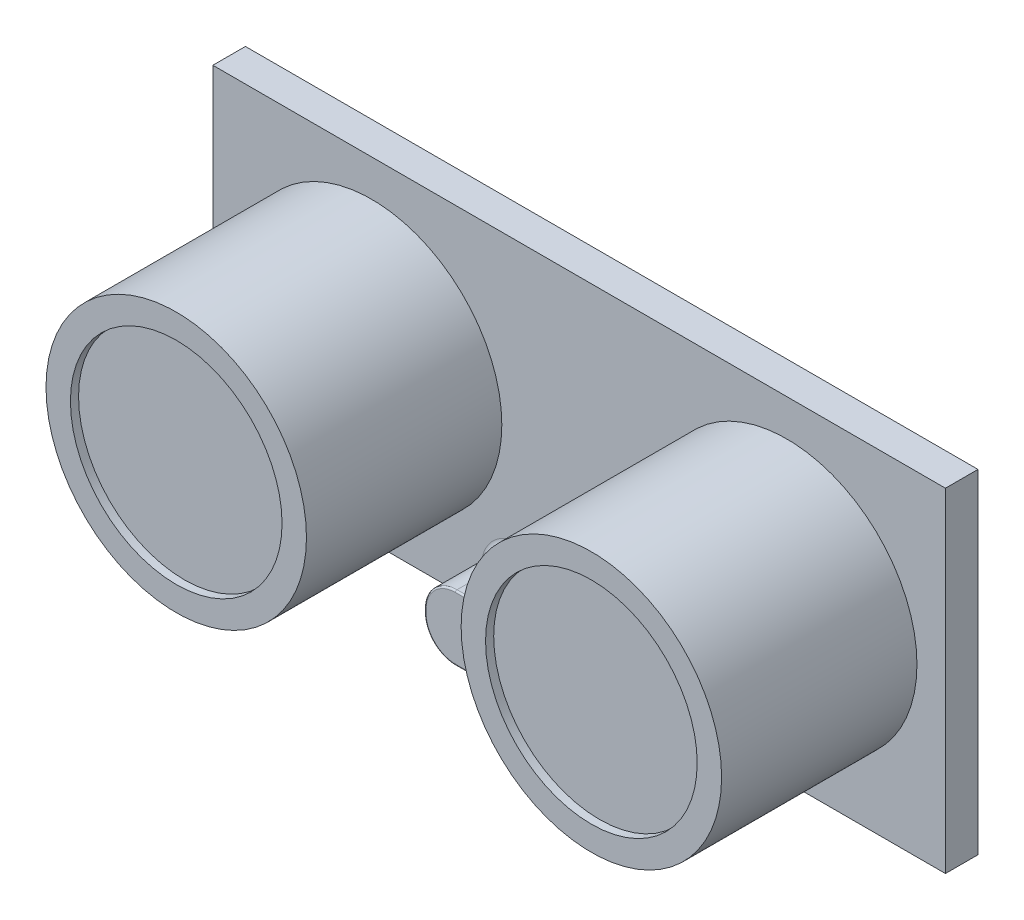
ISO-10303-21;
HEADER;
FILE_DESCRIPTION(('STEP AP214'),'2;1');
FILE_NAME('part.step','',(''),(''),'','','');
FILE_SCHEMA(('AUTOMOTIVE_DESIGN { 1 0 10303 214 1 1 1 1 }'));
ENDSEC;
DATA;
#1=APPLICATION_CONTEXT('core data for automotive mechanical design processes');
#2=APPLICATION_PROTOCOL_DEFINITION('international standard','automotive_design',2000,#1);
#3=PRODUCT_CONTEXT('',#1,'mechanical');
#4=PRODUCT('Part','Part','',(#3));
#5=PRODUCT_RELATED_PRODUCT_CATEGORY('part','',(#4));
#6=PRODUCT_DEFINITION_FORMATION('','',#4);
#7=PRODUCT_DEFINITION_CONTEXT('part definition',#1,'design');
#8=PRODUCT_DEFINITION('design','',#6,#7);
#9=PRODUCT_DEFINITION_SHAPE('','',#8);
#10=(LENGTH_UNIT() NAMED_UNIT(*) SI_UNIT(.MILLI.,.METRE.));
#11=(NAMED_UNIT(*) PLANE_ANGLE_UNIT() SI_UNIT($,.RADIAN.));
#12=(NAMED_UNIT(*) SI_UNIT($,.STERADIAN.) SOLID_ANGLE_UNIT());
#13=UNCERTAINTY_MEASURE_WITH_UNIT(LENGTH_MEASURE(1.E-05),#10,'distance_accuracy_value','');
#14=(GEOMETRIC_REPRESENTATION_CONTEXT(3) GLOBAL_UNCERTAINTY_ASSIGNED_CONTEXT((#13)) GLOBAL_UNIT_ASSIGNED_CONTEXT((#10,
#11,#12)) REPRESENTATION_CONTEXT('',''));
#15=CARTESIAN_POINT('',(0.,0.,0.));
#16=DIRECTION('',(0.,0.,1.));
#17=DIRECTION('',(1.,0.,0.));
#18=AXIS2_PLACEMENT_3D('',#15,#16,#17);
#19=CARTESIAN_POINT('',(0.,0.,2.));
#20=DIRECTION('',(0.,0.,1.));
#21=DIRECTION('',(1.,0.,0.));
#22=AXIS2_PLACEMENT_3D('',#19,#20,#21);
#23=PLANE('',#22);
#24=CARTESIAN_POINT('',(12.75,0.,2.));
#25=DIRECTION('',(0.,0.,1.));
#26=DIRECTION('',(1.,0.,0.));
#27=AXIS2_PLACEMENT_3D('',#24,#25,#26);
#28=CIRCLE('',#27,8.);
#29=CARTESIAN_POINT('',(20.75,0.,2.));
#30=VERTEX_POINT('',#29);
#31=EDGE_CURVE('E199',#30,#30,#28,.T.);
#32=ORIENTED_EDGE('',*,*,#31,.F.);
#33=EDGE_LOOP('',(#32));
#34=FACE_BOUND('',#33,.T.);
#35=CARTESIAN_POINT('',(-12.75,0.,2.));
#36=DIRECTION('',(0.,0.,1.));
#37=DIRECTION('',(1.,0.,0.));
#38=AXIS2_PLACEMENT_3D('',#35,#36,#37);
#39=CIRCLE('',#38,8.);
#40=CARTESIAN_POINT('',(-4.75000000000001,0.,2.));
#41=VERTEX_POINT('',#40);
#42=EDGE_CURVE('E376',#41,#41,#39,.T.);
#43=ORIENTED_EDGE('',*,*,#42,.F.);
#44=EDGE_LOOP('',(#43));
#45=FACE_BOUND('',#44,.T.);
#46=DIRECTION('',(0.,1.,0.));
#47=VECTOR('',#46,1.);
#48=CARTESIAN_POINT('',(5.99999999999999,0.,2.));
#49=LINE('',#48,#47);
#50=CARTESIAN_POINT('',(5.99999999999999,-8.15000000000001,2.));
#51=VERTEX_POINT('',#50);
#52=CARTESIAN_POINT('',(5.99999999999999,-8.34999999999998,2.));
#53=VERTEX_POINT('',#52);
#54=EDGE_CURVE('E279',#51,#53,#49,.F.);
#55=ORIENTED_EDGE('',*,*,#54,.T.);
#56=CARTESIAN_POINT('',(3.59999999999999,-8.34999999999999,2.));
#57=DIRECTION('',(0.,0.,1.));
#58=DIRECTION('',(1.,0.,0.));
#59=AXIS2_PLACEMENT_3D('',#56,#57,#58);
#60=CIRCLE('',#59,2.4);
#61=CARTESIAN_POINT('',(5.06628782986151,-10.25,2.));
#62=VERTEX_POINT('',#61);
#63=EDGE_CURVE('E281',#53,#62,#60,.F.);
#64=ORIENTED_EDGE('',*,*,#63,.T.);
#65=DIRECTION('',(1.,0.,0.));
#66=VECTOR('',#65,1.);
#67=CARTESIAN_POINT('',(22.5,-10.25,2.));
#68=LINE('',#67,#66);
#69=CARTESIAN_POINT('',(22.5,-10.25,2.));
#70=VERTEX_POINT('',#69);
#71=EDGE_CURVE('E185',#62,#70,#68,.T.);
#72=ORIENTED_EDGE('',*,*,#71,.T.);
#73=DIRECTION('',(0.,1.,0.));
#74=VECTOR('',#73,1.);
#75=CARTESIAN_POINT('',(22.5,-10.25,2.));
#76=LINE('',#75,#74);
#77=CARTESIAN_POINT('',(22.5,10.25,2.));
#78=VERTEX_POINT('',#77);
#79=EDGE_CURVE('E184',#70,#78,#76,.T.);
#80=ORIENTED_EDGE('',*,*,#79,.T.);
#81=DIRECTION('',(-1.,0.,0.));
#82=VECTOR('',#81,1.);
#83=CARTESIAN_POINT('',(22.5,10.25,2.));
#84=LINE('',#83,#82);
#85=CARTESIAN_POINT('',(-22.5,10.25,2.));
#86=VERTEX_POINT('',#85);
#87=EDGE_CURVE('E190',#78,#86,#84,.T.);
#88=ORIENTED_EDGE('',*,*,#87,.T.);
#89=DIRECTION('',(0.,-1.,0.));
#90=VECTOR('',#89,1.);
#91=CARTESIAN_POINT('',(-22.5,-10.25,2.));
#92=LINE('',#91,#90);
#93=CARTESIAN_POINT('',(-22.5,-10.25,2.));
#94=VERTEX_POINT('',#93);
#95=EDGE_CURVE('E188',#86,#94,#92,.T.);
#96=ORIENTED_EDGE('',*,*,#95,.T.);
#97=CARTESIAN_POINT('',(-5.06628782986152,-10.25,2.));
#98=VERTEX_POINT('',#97);
#99=EDGE_CURVE('E175',#94,#98,#68,.T.);
#100=ORIENTED_EDGE('',*,*,#99,.T.);
#101=CARTESIAN_POINT('',(-3.60000000000001,-8.35,2.));
#102=DIRECTION('',(0.,0.,1.));
#103=DIRECTION('',(1.,0.,0.));
#104=AXIS2_PLACEMENT_3D('',#101,#102,#103);
#105=CIRCLE('',#104,2.4);
#106=CARTESIAN_POINT('',(-6.00000000000001,-8.35,2.));
#107=VERTEX_POINT('',#106);
#108=EDGE_CURVE('E269',#98,#107,#105,.F.);
#109=ORIENTED_EDGE('',*,*,#108,.T.);
#110=DIRECTION('',(0.,-1.,0.));
#111=VECTOR('',#110,1.);
#112=CARTESIAN_POINT('',(-6.00000000000001,0.,2.));
#113=LINE('',#112,#111);
#114=CARTESIAN_POINT('',(-6.00000000000001,-8.15000000000001,2.));
#115=VERTEX_POINT('',#114);
#116=EDGE_CURVE('E271',#107,#115,#113,.F.);
#117=ORIENTED_EDGE('',*,*,#116,.T.);
#118=CARTESIAN_POINT('',(-3.60000000000001,-8.15,2.));
#119=DIRECTION('',(0.,0.,1.));
#120=DIRECTION('',(1.,0.,0.));
#121=AXIS2_PLACEMENT_3D('',#118,#119,#120);
#122=CIRCLE('',#121,2.4);
#123=CARTESIAN_POINT('',(-3.6,-5.75,2.));
#124=VERTEX_POINT('',#123);
#125=EDGE_CURVE('E273',#115,#124,#122,.F.);
#126=ORIENTED_EDGE('',*,*,#125,.T.);
#127=DIRECTION('',(-1.,0.,0.));
#128=VECTOR('',#127,1.);
#129=CARTESIAN_POINT('',(0.,-5.75,2.));
#130=LINE('',#129,#128);
#131=CARTESIAN_POINT('',(3.59999999999997,-5.74999999999999,2.));
#132=VERTEX_POINT('',#131);
#133=EDGE_CURVE('E275',#124,#132,#130,.F.);
#134=ORIENTED_EDGE('',*,*,#133,.T.);
#135=CARTESIAN_POINT('',(3.59999999999999,-8.15,2.));
#136=DIRECTION('',(0.,0.,1.));
#137=DIRECTION('',(1.,0.,0.));
#138=AXIS2_PLACEMENT_3D('',#135,#136,#137);
#139=CIRCLE('',#138,2.4);
#140=EDGE_CURVE('E277',#132,#51,#139,.F.);
#141=ORIENTED_EDGE('',*,*,#140,.T.);
#142=EDGE_LOOP('',(#55,#64,#72,#80,#88,#96,#100,#109,#117,#126,#134,#141));
#143=FACE_BOUND('',#142,.T.);
#144=ADVANCED_FACE('F34',(#34,#45,#143),#23,.T.);
#145=CARTESIAN_POINT('',(-22.5,-10.25,2.));
#146=DIRECTION('',(1.,0.,0.));
#147=DIRECTION('',(0.,0.,-1.));
#148=AXIS2_PLACEMENT_3D('',#145,#146,#147);
#149=PLANE('',#148);
#150=DIRECTION('',(0.,-1.,0.));
#151=VECTOR('',#150,1.);
#152=CARTESIAN_POINT('',(-22.5,-10.25,0.));
#153=LINE('',#152,#151);
#154=CARTESIAN_POINT('',(-22.5,10.25,0.));
#155=VERTEX_POINT('',#154);
#156=CARTESIAN_POINT('',(-22.5,-10.25,0.));
#157=VERTEX_POINT('',#156);
#158=EDGE_CURVE('E198',#155,#157,#153,.T.);
#159=ORIENTED_EDGE('',*,*,#158,.T.);
#160=DIRECTION('',(0.,0.,-1.));
#161=VECTOR('',#160,1.);
#162=CARTESIAN_POINT('',(-22.5,-10.25,2.));
#163=LINE('',#162,#161);
#164=EDGE_CURVE('E179',#94,#157,#163,.T.);
#165=ORIENTED_EDGE('',*,*,#164,.F.);
#166=ORIENTED_EDGE('',*,*,#95,.F.);
#167=DIRECTION('',(0.,0.,-1.));
#168=VECTOR('',#167,1.);
#169=CARTESIAN_POINT('',(-22.5,10.25,2.));
#170=LINE('',#169,#168);
#171=EDGE_CURVE('E366',#86,#155,#170,.T.);
#172=ORIENTED_EDGE('',*,*,#171,.T.);
#173=EDGE_LOOP('',(#159,#165,#166,#172));
#174=FACE_BOUND('',#173,.T.);
#175=ADVANCED_FACE('F196',(#174),#149,.F.);
#176=CARTESIAN_POINT('',(22.5,-10.25,2.));
#177=DIRECTION('',(0.,1.,0.));
#178=DIRECTION('',(-1.,0.,0.));
#179=AXIS2_PLACEMENT_3D('',#176,#177,#178);
#180=PLANE('',#179);
#181=DIRECTION('',(0.,0.,-1.));
#182=VECTOR('',#181,1.);
#183=CARTESIAN_POINT('',(3.59999999999998,-10.25,6.));
#184=LINE('',#183,#182);
#185=CARTESIAN_POINT('',(3.59999999999998,-10.25,5.9));
#186=VERTEX_POINT('',#185);
#187=CARTESIAN_POINT('',(3.59999999999998,-10.25,2.5));
#188=VERTEX_POINT('',#187);
#189=EDGE_CURVE('E266',#186,#188,#184,.T.);
#190=ORIENTED_EDGE('',*,*,#189,.F.);
#191=DIRECTION('',(1.,0.,0.));
#192=VECTOR('',#191,1.);
#193=CARTESIAN_POINT('',(-3.6,-10.25,5.9));
#194=LINE('',#193,#192);
#195=CARTESIAN_POINT('',(-3.6,-10.25,5.9));
#196=VERTEX_POINT('',#195);
#197=EDGE_CURVE('E226',#186,#196,#194,.F.);
#198=ORIENTED_EDGE('',*,*,#197,.T.);
#199=DIRECTION('',(0.,0.,-1.));
#200=VECTOR('',#199,1.);
#201=CARTESIAN_POINT('',(-3.6,-10.25,6.));
#202=LINE('',#201,#200);
#203=CARTESIAN_POINT('',(-3.6,-10.25,2.5));
#204=VERTEX_POINT('',#203);
#205=EDGE_CURVE('E413',#196,#204,#202,.T.);
#206=ORIENTED_EDGE('',*,*,#205,.T.);
#207=CARTESIAN_POINT('',(-5.06628782986153,-10.25,2.));
#208=CARTESIAN_POINT('',(-5.02362873251062,-10.25,2.00001494778449));
#209=CARTESIAN_POINT('',(-4.98102613340885,-10.25,2.00203480701246));
#210=CARTESIAN_POINT('',(-4.89620487210437,-10.25,2.00952420769664));
#211=CARTESIAN_POINT('',(-4.85398560732806,-10.25,2.01498675855631));
#212=CARTESIAN_POINT('',(-4.72906875544723,-10.25,2.0355476634458));
#213=CARTESIAN_POINT('',(-4.64706899493272,-10.25,2.05484736958768));
#214=CARTESIAN_POINT('',(-4.48265855424341,-10.25,2.10226646336266));
#215=CARTESIAN_POINT('',(-4.40033531717154,-10.25,2.13067281672156));
#216=CARTESIAN_POINT('',(-4.23792922056108,-10.25,2.1933491256377));
#217=CARTESIAN_POINT('',(-4.15784816758663,-10.25,2.22762365958983));
#218=CARTESIAN_POINT('',(-3.91933125131494,-10.25,2.33626077765488));
#219=CARTESIAN_POINT('',(-3.76348106128888,-10.25,2.41613718563257));
#220=CARTESIAN_POINT('',(-3.60517112611296,-10.25,2.4973472886442));
#221=CARTESIAN_POINT('',(-3.60258555328266,-10.25,2.49867366006384));
#222=CARTESIAN_POINT('',(-3.60000000000001,-10.25,2.5));
#223=B_SPLINE_CURVE_WITH_KNOTS('',3,(#207,#208,#209,#210,#211,#212,#213,#214,#215,#216,#217,
#218,#219,#220,#221,#222),.UNSPECIFIED.,.F.,.F.,(4,2,2,2,2,2,2,4),(0.,0.127846166015326,
0.25543356528269,0.50750855969959,0.768470990310088,1.02963796124316,1.5546879556882,
1.56340575360097),.UNSPECIFIED.);
#224=EDGE_CURVE('E11',#204,#98,#223,.F.);
#225=ORIENTED_EDGE('',*,*,#224,.T.);
#226=ORIENTED_EDGE('',*,*,#99,.F.);
#227=ORIENTED_EDGE('',*,*,#164,.T.);
#228=DIRECTION('',(1.,0.,0.));
#229=VECTOR('',#228,1.);
#230=CARTESIAN_POINT('',(22.5,-10.25,0.));
#231=LINE('',#230,#229);
#232=CARTESIAN_POINT('',(22.5,-10.25,0.));
#233=VERTEX_POINT('',#232);
#234=EDGE_CURVE('E364',#157,#233,#231,.T.);
#235=ORIENTED_EDGE('',*,*,#234,.T.);
#236=DIRECTION('',(0.,0.,-1.));
#237=VECTOR('',#236,1.);
#238=CARTESIAN_POINT('',(22.5,-10.25,2.));
#239=LINE('',#238,#237);
#240=EDGE_CURVE('E200',#70,#233,#239,.T.);
#241=ORIENTED_EDGE('',*,*,#240,.F.);
#242=ORIENTED_EDGE('',*,*,#71,.F.);
#243=CARTESIAN_POINT('',(5.0662878298615,-10.25,2.));
#244=CARTESIAN_POINT('',(5.02362873251065,-10.25,2.00001494778449));
#245=CARTESIAN_POINT('',(4.98102613340894,-10.25,2.00203480701245));
#246=CARTESIAN_POINT('',(4.89620487210456,-10.25,2.00952420769661));
#247=CARTESIAN_POINT('',(4.85398560732829,-10.25,2.01498675855627));
#248=CARTESIAN_POINT('',(4.7290687554474,-10.25,2.03554766344576));
#249=CARTESIAN_POINT('',(4.64706899493281,-10.25,2.05484736958767));
#250=CARTESIAN_POINT('',(4.48265855424336,-10.25,2.10226646336265));
#251=CARTESIAN_POINT('',(4.40033531717146,-10.25,2.13067281672149));
#252=CARTESIAN_POINT('',(4.23792922056102,-10.25,2.1933491256378));
#253=CARTESIAN_POINT('',(4.15784816758663,-10.25,2.22762365959015));
#254=CARTESIAN_POINT('',(3.91933125131454,-10.25,2.33626077765437));
#255=CARTESIAN_POINT('',(3.76348106128725,-10.2500000000001,2.41613718562953));
#256=CARTESIAN_POINT('',(3.60517112611289,-10.25,2.4973472886441));
#257=CARTESIAN_POINT('',(3.60258555328261,-10.25,2.49867366006379));
#258=CARTESIAN_POINT('',(3.59999999999999,-10.25,2.5));
#259=B_SPLINE_CURVE_WITH_KNOTS('',3,(#243,#244,#245,#246,#247,#248,#249,#250,#251,#252,#253,
#254,#255,#256,#257,#258),.UNSPECIFIED.,.F.,.F.,(4,2,2,2,2,2,2,4),(0.,0.127846166015155,
0.255433565282388,0.50750855969959,0.768470990310128,1.02963796124332,1.5546879556882,
1.56340575360097),.UNSPECIFIED.);
#260=EDGE_CURVE('E44',#62,#188,#259,.T.);
#261=ORIENTED_EDGE('',*,*,#260,.T.);
#262=EDGE_LOOP('',(#190,#198,#206,#225,#226,#227,#235,#241,#242,#261));
#263=FACE_BOUND('',#262,.T.);
#264=ADVANCED_FACE('F177',(#263),#180,.F.);
#265=CARTESIAN_POINT('',(22.5,-10.25,2.));
#266=DIRECTION('',(-1.,0.,0.));
#267=DIRECTION('',(0.,0.,1.));
#268=AXIS2_PLACEMENT_3D('',#265,#266,#267);
#269=PLANE('',#268);
#270=DIRECTION('',(0.,1.,0.));
#271=VECTOR('',#270,1.);
#272=CARTESIAN_POINT('',(22.5,-10.25,0.));
#273=LINE('',#272,#271);
#274=CARTESIAN_POINT('',(22.5,10.25,0.));
#275=VERTEX_POINT('',#274);
#276=EDGE_CURVE('E359',#233,#275,#273,.T.);
#277=ORIENTED_EDGE('',*,*,#276,.T.);
#278=DIRECTION('',(0.,0.,-1.));
#279=VECTOR('',#278,1.);
#280=CARTESIAN_POINT('',(22.5,10.25,2.));
#281=LINE('',#280,#279);
#282=EDGE_CURVE('E206',#78,#275,#281,.T.);
#283=ORIENTED_EDGE('',*,*,#282,.F.);
#284=ORIENTED_EDGE('',*,*,#79,.F.);
#285=ORIENTED_EDGE('',*,*,#240,.T.);
#286=EDGE_LOOP('',(#277,#283,#284,#285));
#287=FACE_BOUND('',#286,.T.);
#288=ADVANCED_FACE('F350',(#287),#269,.F.);
#289=CARTESIAN_POINT('',(22.5,10.25,2.));
#290=DIRECTION('',(0.,-1.,0.));
#291=DIRECTION('',(1.,0.,0.));
#292=AXIS2_PLACEMENT_3D('',#289,#290,#291);
#293=PLANE('',#292);
#294=DIRECTION('',(-1.,0.,0.));
#295=VECTOR('',#294,1.);
#296=CARTESIAN_POINT('',(22.5,10.25,0.));
#297=LINE('',#296,#295);
#298=EDGE_CURVE('E194',#275,#155,#297,.T.);
#299=ORIENTED_EDGE('',*,*,#298,.T.);
#300=ORIENTED_EDGE('',*,*,#171,.F.);
#301=ORIENTED_EDGE('',*,*,#87,.F.);
#302=ORIENTED_EDGE('',*,*,#282,.T.);
#303=EDGE_LOOP('',(#299,#300,#301,#302));
#304=FACE_BOUND('',#303,.T.);
#305=ADVANCED_FACE('F347',(#304),#293,.F.);
#306=CARTESIAN_POINT('',(0.,0.,0.));
#307=DIRECTION('',(0.,0.,1.));
#308=DIRECTION('',(1.,0.,0.));
#309=AXIS2_PLACEMENT_3D('',#306,#307,#308);
#310=PLANE('',#309);
#311=ORIENTED_EDGE('',*,*,#158,.F.);
#312=ORIENTED_EDGE('',*,*,#298,.F.);
#313=ORIENTED_EDGE('',*,*,#276,.F.);
#314=ORIENTED_EDGE('',*,*,#234,.F.);
#315=EDGE_LOOP('',(#311,#312,#313,#314));
#316=FACE_BOUND('',#315,.T.);
#317=ADVANCED_FACE('F344',(#316),#310,.F.);
#318=CARTESIAN_POINT('',(-12.75,0.,14.));
#319=DIRECTION('',(0.,0.,-1.));
#320=DIRECTION('',(-1.,0.,0.));
#321=AXIS2_PLACEMENT_3D('',#318,#319,#320);
#322=CYLINDRICAL_SURFACE('',#321,8.);
#323=CARTESIAN_POINT('',(-12.75,0.,14.));
#324=DIRECTION('',(0.,0.,1.));
#325=DIRECTION('',(1.,0.,0.));
#326=AXIS2_PLACEMENT_3D('',#323,#324,#325);
#327=CIRCLE('',#326,8.);
#328=CARTESIAN_POINT('',(-4.75000000000001,0.,14.));
#329=VERTEX_POINT('',#328);
#330=EDGE_CURVE('E373',#329,#329,#327,.T.);
#331=ORIENTED_EDGE('',*,*,#330,.F.);
#332=EDGE_LOOP('',(#331));
#333=FACE_BOUND('',#332,.T.);
#334=ORIENTED_EDGE('',*,*,#42,.T.);
#335=EDGE_LOOP('',(#334));
#336=FACE_BOUND('',#335,.T.);
#337=ADVANCED_FACE('F342',(#333,#336),#322,.T.);
#338=CARTESIAN_POINT('',(0.,0.,14.));
#339=DIRECTION('',(0.,0.,1.));
#340=DIRECTION('',(1.,0.,0.));
#341=AXIS2_PLACEMENT_3D('',#338,#339,#340);
#342=PLANE('',#341);
#343=CARTESIAN_POINT('',(-12.75,0.,14.));
#344=DIRECTION('',(0.,0.,1.));
#345=DIRECTION('',(1.,0.,0.));
#346=AXIS2_PLACEMENT_3D('',#343,#344,#345);
#347=CIRCLE('',#346,6.5);
#348=CARTESIAN_POINT('',(-6.25000000000001,0.,14.));
#349=VERTEX_POINT('',#348);
#350=EDGE_CURVE('E385',#349,#349,#347,.T.);
#351=ORIENTED_EDGE('',*,*,#350,.F.);
#352=EDGE_LOOP('',(#351));
#353=FACE_BOUND('',#352,.T.);
#354=ORIENTED_EDGE('',*,*,#330,.T.);
#355=EDGE_LOOP('',(#354));
#356=FACE_BOUND('',#355,.T.);
#357=ADVANCED_FACE('F732',(#353,#356),#342,.T.);
#358=CARTESIAN_POINT('',(12.75,0.,14.));
#359=DIRECTION('',(0.,0.,-1.));
#360=DIRECTION('',(-1.,0.,0.));
#361=AXIS2_PLACEMENT_3D('',#358,#359,#360);
#362=CYLINDRICAL_SURFACE('',#361,8.);
#363=CARTESIAN_POINT('',(12.75,0.,14.));
#364=DIRECTION('',(0.,0.,1.));
#365=DIRECTION('',(1.,0.,0.));
#366=AXIS2_PLACEMENT_3D('',#363,#364,#365);
#367=CIRCLE('',#366,8.);
#368=CARTESIAN_POINT('',(20.75,0.,14.));
#369=VERTEX_POINT('',#368);
#370=EDGE_CURVE('E379',#369,#369,#367,.F.);
#371=ORIENTED_EDGE('',*,*,#370,.T.);
#372=EDGE_LOOP('',(#371));
#373=FACE_BOUND('',#372,.T.);
#374=ORIENTED_EDGE('',*,*,#31,.T.);
#375=EDGE_LOOP('',(#374));
#376=FACE_BOUND('',#375,.T.);
#377=ADVANCED_FACE('F724',(#373,#376),#362,.T.);
#378=CARTESIAN_POINT('',(0.,0.,14.));
#379=DIRECTION('',(0.,0.,1.));
#380=DIRECTION('',(1.,0.,0.));
#381=AXIS2_PLACEMENT_3D('',#378,#379,#380);
#382=PLANE('',#381);
#383=CARTESIAN_POINT('',(12.75,0.,14.));
#384=DIRECTION('',(0.,0.,1.));
#385=DIRECTION('',(-1.,0.,0.));
#386=AXIS2_PLACEMENT_3D('',#383,#384,#385);
#387=CIRCLE('',#386,6.5);
#388=CARTESIAN_POINT('',(6.24999999999999,0.,14.));
#389=VERTEX_POINT('',#388);
#390=EDGE_CURVE('E391',#389,#389,#387,.T.);
#391=ORIENTED_EDGE('',*,*,#390,.F.);
#392=EDGE_LOOP('',(#391));
#393=FACE_BOUND('',#392,.T.);
#394=ORIENTED_EDGE('',*,*,#370,.F.);
#395=EDGE_LOOP('',(#394));
#396=FACE_BOUND('',#395,.T.);
#397=ADVANCED_FACE('F714',(#393,#396),#382,.T.);
#398=CARTESIAN_POINT('',(-12.75,0.,13.5));
#399=DIRECTION('',(0.,0.,1.));
#400=DIRECTION('',(1.,0.,0.));
#401=AXIS2_PLACEMENT_3D('',#398,#399,#400);
#402=CYLINDRICAL_SURFACE('',#401,6.5);
#403=CARTESIAN_POINT('',(-12.75,0.,13.5));
#404=DIRECTION('',(0.,0.,1.));
#405=DIRECTION('',(1.,0.,0.));
#406=AXIS2_PLACEMENT_3D('',#403,#404,#405);
#407=CIRCLE('',#406,6.5);
#408=CARTESIAN_POINT('',(-6.25000000000001,0.,13.5));
#409=VERTEX_POINT('',#408);
#410=EDGE_CURVE('E384',#409,#409,#407,.T.);
#411=ORIENTED_EDGE('',*,*,#410,.F.);
#412=EDGE_LOOP('',(#411));
#413=FACE_BOUND('',#412,.T.);
#414=ORIENTED_EDGE('',*,*,#350,.T.);
#415=EDGE_LOOP('',(#414));
#416=FACE_BOUND('',#415,.T.);
#417=ADVANCED_FACE('F704',(#413,#416),#402,.F.);
#418=CARTESIAN_POINT('',(-12.75,0.,13.5));
#419=DIRECTION('',(0.,0.,1.));
#420=DIRECTION('',(1.,0.,0.));
#421=AXIS2_PLACEMENT_3D('',#418,#419,#420);
#422=PLANE('',#421);
#423=ORIENTED_EDGE('',*,*,#410,.T.);
#424=EDGE_LOOP('',(#423));
#425=FACE_BOUND('',#424,.T.);
#426=ADVANCED_FACE('F694',(#425),#422,.T.);
#427=CARTESIAN_POINT('',(12.75,0.,13.5));
#428=DIRECTION('',(0.,0.,1.));
#429=DIRECTION('',(1.,0.,0.));
#430=AXIS2_PLACEMENT_3D('',#427,#428,#429);
#431=CYLINDRICAL_SURFACE('',#430,6.5);
#432=CARTESIAN_POINT('',(12.75,0.,13.5));
#433=DIRECTION('',(0.,0.,1.));
#434=DIRECTION('',(-1.,0.,0.));
#435=AXIS2_PLACEMENT_3D('',#432,#433,#434);
#436=CIRCLE('',#435,6.5);
#437=CARTESIAN_POINT('',(6.24999999999999,0.,13.5));
#438=VERTEX_POINT('',#437);
#439=EDGE_CURVE('E388',#438,#438,#436,.T.);
#440=ORIENTED_EDGE('',*,*,#439,.F.);
#441=EDGE_LOOP('',(#440));
#442=FACE_BOUND('',#441,.T.);
#443=ORIENTED_EDGE('',*,*,#390,.T.);
#444=EDGE_LOOP('',(#443));
#445=FACE_BOUND('',#444,.T.);
#446=ADVANCED_FACE('F684',(#442,#445),#431,.F.);
#447=CARTESIAN_POINT('',(12.75,0.,13.5));
#448=DIRECTION('',(0.,0.,-1.));
#449=DIRECTION('',(-1.,0.,0.));
#450=AXIS2_PLACEMENT_3D('',#447,#448,#449);
#451=PLANE('',#450);
#452=ORIENTED_EDGE('',*,*,#439,.T.);
#453=EDGE_LOOP('',(#452));
#454=FACE_BOUND('',#453,.T.);
#455=ADVANCED_FACE('F604',(#454),#451,.F.);
#456=CARTESIAN_POINT('',(3.59999999999999,-8.34999999999999,6.));
#457=DIRECTION('',(0.,0.,-1.));
#458=DIRECTION('',(-1.,0.,0.));
#459=AXIS2_PLACEMENT_3D('',#456,#457,#458);
#460=CYLINDRICAL_SURFACE('',#459,1.9);
#461=ORIENTED_EDGE('',*,*,#189,.T.);
#462=CARTESIAN_POINT('',(3.59999999999999,-8.34999999999999,2.5));
#463=DIRECTION('',(0.,0.,1.));
#464=DIRECTION('',(1.,0.,0.));
#465=AXIS2_PLACEMENT_3D('',#462,#463,#464);
#466=CIRCLE('',#465,1.9);
#467=CARTESIAN_POINT('',(5.49999999999999,-8.34999999999998,2.5));
#468=VERTEX_POINT('',#467);
#469=EDGE_CURVE('E291',#188,#468,#466,.T.);
#470=ORIENTED_EDGE('',*,*,#469,.T.);
#471=DIRECTION('',(0.,0.,-1.));
#472=VECTOR('',#471,1.);
#473=CARTESIAN_POINT('',(5.49999999999999,-8.34999999999998,6.));
#474=LINE('',#473,#472);
#475=CARTESIAN_POINT('',(5.49999999999999,-8.34999999999998,5.9));
#476=VERTEX_POINT('',#475);
#477=EDGE_CURVE('E394',#476,#468,#474,.T.);
#478=ORIENTED_EDGE('',*,*,#477,.F.);
#479=CARTESIAN_POINT('',(3.59999999999999,-8.34999999999999,5.9));
#480=DIRECTION('',(0.,0.,1.));
#481=DIRECTION('',(1.,0.,0.));
#482=AXIS2_PLACEMENT_3D('',#479,#480,#481);
#483=CIRCLE('',#482,1.9);
#484=EDGE_CURVE('E241',#476,#186,#483,.F.);
#485=ORIENTED_EDGE('',*,*,#484,.T.);
#486=EDGE_LOOP('',(#461,#470,#478,#485));
#487=FACE_BOUND('',#486,.T.);
#488=ADVANCED_FACE('F417',(#487),#460,.T.);
#489=CARTESIAN_POINT('',(5.49999999999999,-8.34999999999998,6.));
#490=DIRECTION('',(-1.,0.,0.));
#491=DIRECTION('',(0.,0.,1.));
#492=AXIS2_PLACEMENT_3D('',#489,#490,#491);
#493=PLANE('',#492);
#494=ORIENTED_EDGE('',*,*,#477,.T.);
#495=DIRECTION('',(0.,1.,0.));
#496=VECTOR('',#495,1.);
#497=CARTESIAN_POINT('',(5.49999999999999,-8.34999999999998,2.5));
#498=LINE('',#497,#496);
#499=CARTESIAN_POINT('',(5.49999999999999,-8.15000000000001,2.5));
#500=VERTEX_POINT('',#499);
#501=EDGE_CURVE('E243',#468,#500,#498,.T.);
#502=ORIENTED_EDGE('',*,*,#501,.T.);
#503=DIRECTION('',(0.,0.,-1.));
#504=VECTOR('',#503,1.);
#505=CARTESIAN_POINT('',(5.49999999999999,-8.15000000000001,6.));
#506=LINE('',#505,#504);
#507=CARTESIAN_POINT('',(5.49999999999999,-8.15000000000001,5.9));
#508=VERTEX_POINT('',#507);
#509=EDGE_CURVE('E399',#508,#500,#506,.T.);
#510=ORIENTED_EDGE('',*,*,#509,.F.);
#511=DIRECTION('',(0.,1.,0.));
#512=VECTOR('',#511,1.);
#513=CARTESIAN_POINT('',(5.49999999999999,-8.34999999999998,5.9));
#514=LINE('',#513,#512);
#515=EDGE_CURVE('E239',#508,#476,#514,.F.);
#516=ORIENTED_EDGE('',*,*,#515,.T.);
#517=EDGE_LOOP('',(#494,#502,#510,#516));
#518=FACE_BOUND('',#517,.T.);
#519=ADVANCED_FACE('F435',(#518),#493,.F.);
#520=CARTESIAN_POINT('',(3.59999999999999,-8.15,6.));
#521=DIRECTION('',(0.,0.,-1.));
#522=DIRECTION('',(-1.,0.,0.));
#523=AXIS2_PLACEMENT_3D('',#520,#521,#522);
#524=CYLINDRICAL_SURFACE('',#523,1.9);
#525=ORIENTED_EDGE('',*,*,#509,.T.);
#526=CARTESIAN_POINT('',(3.59999999999999,-8.15,2.5));
#527=DIRECTION('',(0.,0.,1.));
#528=DIRECTION('',(1.,0.,0.));
#529=AXIS2_PLACEMENT_3D('',#526,#527,#528);
#530=CIRCLE('',#529,1.9);
#531=CARTESIAN_POINT('',(3.59999999999998,-6.25,2.5));
#532=VERTEX_POINT('',#531);
#533=EDGE_CURVE('E283',#500,#532,#530,.T.);
#534=ORIENTED_EDGE('',*,*,#533,.T.);
#535=DIRECTION('',(0.,0.,-1.));
#536=VECTOR('',#535,1.);
#537=CARTESIAN_POINT('',(3.59999999999998,-6.25,6.));
#538=LINE('',#537,#536);
#539=CARTESIAN_POINT('',(3.59999999999998,-6.25,5.9));
#540=VERTEX_POINT('',#539);
#541=EDGE_CURVE('E402',#540,#532,#538,.T.);
#542=ORIENTED_EDGE('',*,*,#541,.F.);
#543=CARTESIAN_POINT('',(3.59999999999999,-8.15,5.9));
#544=DIRECTION('',(0.,0.,1.));
#545=DIRECTION('',(1.,0.,0.));
#546=AXIS2_PLACEMENT_3D('',#543,#544,#545);
#547=CIRCLE('',#546,1.9);
#548=EDGE_CURVE('E237',#540,#508,#547,.F.);
#549=ORIENTED_EDGE('',*,*,#548,.T.);
#550=EDGE_LOOP('',(#525,#534,#542,#549));
#551=FACE_BOUND('',#550,.T.);
#552=ADVANCED_FACE('F438',(#551),#524,.T.);
#553=CARTESIAN_POINT('',(3.59999999999998,-6.25,6.));
#554=DIRECTION('',(0.,-1.,0.));
#555=DIRECTION('',(1.,0.,0.));
#556=AXIS2_PLACEMENT_3D('',#553,#554,#555);
#557=PLANE('',#556);
#558=ORIENTED_EDGE('',*,*,#541,.T.);
#559=DIRECTION('',(-1.,0.,0.));
#560=VECTOR('',#559,1.);
#561=CARTESIAN_POINT('',(3.59999999999998,-6.25,2.5));
#562=LINE('',#561,#560);
#563=CARTESIAN_POINT('',(-3.6,-6.25,2.5));
#564=VERTEX_POINT('',#563);
#565=EDGE_CURVE('E285',#532,#564,#562,.T.);
#566=ORIENTED_EDGE('',*,*,#565,.T.);
#567=DIRECTION('',(0.,0.,-1.));
#568=VECTOR('',#567,1.);
#569=CARTESIAN_POINT('',(-3.6,-6.25,6.));
#570=LINE('',#569,#568);
#571=CARTESIAN_POINT('',(-3.6,-6.25,5.9));
#572=VERTEX_POINT('',#571);
#573=EDGE_CURVE('E405',#572,#564,#570,.T.);
#574=ORIENTED_EDGE('',*,*,#573,.F.);
#575=DIRECTION('',(-1.,0.,0.));
#576=VECTOR('',#575,1.);
#577=CARTESIAN_POINT('',(3.59999999999998,-6.25,5.9));
#578=LINE('',#577,#576);
#579=EDGE_CURVE('E235',#572,#540,#578,.F.);
#580=ORIENTED_EDGE('',*,*,#579,.T.);
#581=EDGE_LOOP('',(#558,#566,#574,#580));
#582=FACE_BOUND('',#581,.T.);
#583=ADVANCED_FACE('F487',(#582),#557,.F.);
#584=CARTESIAN_POINT('',(-3.60000000000001,-8.15,6.));
#585=DIRECTION('',(0.,0.,-1.));
#586=DIRECTION('',(-1.,0.,0.));
#587=AXIS2_PLACEMENT_3D('',#584,#585,#586);
#588=CYLINDRICAL_SURFACE('',#587,1.9);
#589=ORIENTED_EDGE('',*,*,#573,.T.);
#590=CARTESIAN_POINT('',(-3.60000000000001,-8.15,2.5));
#591=DIRECTION('',(0.,0.,1.));
#592=DIRECTION('',(1.,0.,0.));
#593=AXIS2_PLACEMENT_3D('',#590,#591,#592);
#594=CIRCLE('',#593,1.9);
#595=CARTESIAN_POINT('',(-5.50000000000001,-8.15000000000001,2.5));
#596=VERTEX_POINT('',#595);
#597=EDGE_CURVE('E287',#564,#596,#594,.T.);
#598=ORIENTED_EDGE('',*,*,#597,.T.);
#599=DIRECTION('',(0.,0.,-1.));
#600=VECTOR('',#599,1.);
#601=CARTESIAN_POINT('',(-5.50000000000001,-8.15000000000001,6.));
#602=LINE('',#601,#600);
#603=CARTESIAN_POINT('',(-5.50000000000001,-8.15000000000001,5.9));
#604=VERTEX_POINT('',#603);
#605=EDGE_CURVE('E408',#604,#596,#602,.T.);
#606=ORIENTED_EDGE('',*,*,#605,.F.);
#607=CARTESIAN_POINT('',(-3.60000000000001,-8.15,5.9));
#608=DIRECTION('',(0.,0.,1.));
#609=DIRECTION('',(1.,0.,0.));
#610=AXIS2_PLACEMENT_3D('',#607,#608,#609);
#611=CIRCLE('',#610,1.9);
#612=EDGE_CURVE('E233',#604,#572,#611,.F.);
#613=ORIENTED_EDGE('',*,*,#612,.T.);
#614=EDGE_LOOP('',(#589,#598,#606,#613));
#615=FACE_BOUND('',#614,.T.);
#616=ADVANCED_FACE('F483',(#615),#588,.T.);
#617=CARTESIAN_POINT('',(-5.50000000000001,-8.34999999999998,6.));
#618=DIRECTION('',(1.,0.,0.));
#619=DIRECTION('',(0.,0.,-1.));
#620=AXIS2_PLACEMENT_3D('',#617,#618,#619);
#621=PLANE('',#620);
#622=ORIENTED_EDGE('',*,*,#605,.T.);
#623=DIRECTION('',(0.,-1.,0.));
#624=VECTOR('',#623,1.);
#625=CARTESIAN_POINT('',(-5.50000000000001,-8.34999999999998,2.5));
#626=LINE('',#625,#624);
#627=CARTESIAN_POINT('',(-5.50000000000001,-8.35,2.5));
#628=VERTEX_POINT('',#627);
#629=EDGE_CURVE('E289',#596,#628,#626,.T.);
#630=ORIENTED_EDGE('',*,*,#629,.T.);
#631=DIRECTION('',(0.,0.,-1.));
#632=VECTOR('',#631,1.);
#633=CARTESIAN_POINT('',(-5.50000000000001,-8.35,6.));
#634=LINE('',#633,#632);
#635=CARTESIAN_POINT('',(-5.50000000000001,-8.35,5.9));
#636=VERTEX_POINT('',#635);
#637=EDGE_CURVE('E411',#636,#628,#634,.T.);
#638=ORIENTED_EDGE('',*,*,#637,.F.);
#639=DIRECTION('',(0.,-1.,0.));
#640=VECTOR('',#639,1.);
#641=CARTESIAN_POINT('',(-5.50000000000001,-8.15000000000001,5.9));
#642=LINE('',#641,#640);
#643=EDGE_CURVE('E231',#636,#604,#642,.F.);
#644=ORIENTED_EDGE('',*,*,#643,.T.);
#645=EDGE_LOOP('',(#622,#630,#638,#644));
#646=FACE_BOUND('',#645,.T.);
#647=ADVANCED_FACE('F463',(#646),#621,.F.);
#648=CARTESIAN_POINT('',(-3.60000000000001,-8.35,6.));
#649=DIRECTION('',(0.,0.,-1.));
#650=DIRECTION('',(-1.,0.,0.));
#651=AXIS2_PLACEMENT_3D('',#648,#649,#650);
#652=CYLINDRICAL_SURFACE('',#651,1.9);
#653=ORIENTED_EDGE('',*,*,#637,.T.);
#654=CARTESIAN_POINT('',(-3.60000000000001,-8.35,2.5));
#655=DIRECTION('',(0.,0.,1.));
#656=DIRECTION('',(1.,0.,0.));
#657=AXIS2_PLACEMENT_3D('',#654,#655,#656);
#658=CIRCLE('',#657,1.9);
#659=EDGE_CURVE('E52',#628,#204,#658,.T.);
#660=ORIENTED_EDGE('',*,*,#659,.T.);
#661=ORIENTED_EDGE('',*,*,#205,.F.);
#662=CARTESIAN_POINT('',(-3.60000000000001,-8.35,5.9));
#663=DIRECTION('',(0.,0.,1.));
#664=DIRECTION('',(1.,0.,0.));
#665=AXIS2_PLACEMENT_3D('',#662,#663,#664);
#666=CIRCLE('',#665,1.9);
#667=EDGE_CURVE('E229',#196,#636,#666,.F.);
#668=ORIENTED_EDGE('',*,*,#667,.T.);
#669=EDGE_LOOP('',(#653,#660,#661,#668));
#670=FACE_BOUND('',#669,.T.);
#671=ADVANCED_FACE('F458',(#670),#652,.T.);
#672=CARTESIAN_POINT('',(3.59999999999999,-8.34999999999999,6.));
#673=DIRECTION('',(0.,0.,1.));
#674=DIRECTION('',(1.,0.,0.));
#675=AXIS2_PLACEMENT_3D('',#672,#673,#674);
#676=PLANE('',#675);
#677=CARTESIAN_POINT('',(-3.60000000000001,-8.35,6.));
#678=DIRECTION('',(0.,0.,1.));
#679=DIRECTION('',(1.,0.,0.));
#680=AXIS2_PLACEMENT_3D('',#677,#678,#679);
#681=CIRCLE('',#680,1.8);
#682=CARTESIAN_POINT('',(-5.40000000000001,-8.35,6.));
#683=VERTEX_POINT('',#682);
#684=CARTESIAN_POINT('',(-3.6,-10.15,6.));
#685=VERTEX_POINT('',#684);
#686=EDGE_CURVE('E221',#683,#685,#681,.T.);
#687=ORIENTED_EDGE('',*,*,#686,.T.);
#688=DIRECTION('',(1.,0.,0.));
#689=VECTOR('',#688,1.);
#690=CARTESIAN_POINT('',(3.59999999999998,-10.15,6.));
#691=LINE('',#690,#689);
#692=CARTESIAN_POINT('',(3.59999999999998,-10.15,6.));
#693=VERTEX_POINT('',#692);
#694=EDGE_CURVE('E223',#685,#693,#691,.T.);
#695=ORIENTED_EDGE('',*,*,#694,.T.);
#696=CARTESIAN_POINT('',(3.59999999999999,-8.34999999999999,6.));
#697=DIRECTION('',(0.,0.,1.));
#698=DIRECTION('',(1.,0.,0.));
#699=AXIS2_PLACEMENT_3D('',#696,#697,#698);
#700=CIRCLE('',#699,1.8);
#701=CARTESIAN_POINT('',(5.39999999999999,-8.34999999999998,6.));
#702=VERTEX_POINT('',#701);
#703=EDGE_CURVE('E203',#693,#702,#700,.T.);
#704=ORIENTED_EDGE('',*,*,#703,.T.);
#705=DIRECTION('',(0.,1.,0.));
#706=VECTOR('',#705,1.);
#707=CARTESIAN_POINT('',(5.39999999999999,-8.15000000000001,6.));
#708=LINE('',#707,#706);
#709=CARTESIAN_POINT('',(5.39999999999999,-8.15000000000001,6.));
#710=VERTEX_POINT('',#709);
#711=EDGE_CURVE('E211',#702,#710,#708,.T.);
#712=ORIENTED_EDGE('',*,*,#711,.T.);
#713=CARTESIAN_POINT('',(3.59999999999999,-8.15,6.));
#714=DIRECTION('',(0.,0.,1.));
#715=DIRECTION('',(1.,0.,0.));
#716=AXIS2_PLACEMENT_3D('',#713,#714,#715);
#717=CIRCLE('',#716,1.8);
#718=CARTESIAN_POINT('',(3.59999999999998,-6.35,6.));
#719=VERTEX_POINT('',#718);
#720=EDGE_CURVE('E213',#710,#719,#717,.T.);
#721=ORIENTED_EDGE('',*,*,#720,.T.);
#722=DIRECTION('',(-1.,0.,0.));
#723=VECTOR('',#722,1.);
#724=CARTESIAN_POINT('',(-3.6,-6.35,6.));
#725=LINE('',#724,#723);
#726=CARTESIAN_POINT('',(-3.6,-6.35,6.));
#727=VERTEX_POINT('',#726);
#728=EDGE_CURVE('E215',#719,#727,#725,.T.);
#729=ORIENTED_EDGE('',*,*,#728,.T.);
#730=CARTESIAN_POINT('',(-3.60000000000001,-8.15,6.));
#731=DIRECTION('',(0.,0.,1.));
#732=DIRECTION('',(1.,0.,0.));
#733=AXIS2_PLACEMENT_3D('',#730,#731,#732);
#734=CIRCLE('',#733,1.8);
#735=CARTESIAN_POINT('',(-5.40000000000001,-8.15000000000001,6.));
#736=VERTEX_POINT('',#735);
#737=EDGE_CURVE('E217',#727,#736,#734,.T.);
#738=ORIENTED_EDGE('',*,*,#737,.T.);
#739=DIRECTION('',(0.,-1.,0.));
#740=VECTOR('',#739,1.);
#741=CARTESIAN_POINT('',(-5.40000000000001,-8.35,6.));
#742=LINE('',#741,#740);
#743=EDGE_CURVE('E219',#736,#683,#742,.T.);
#744=ORIENTED_EDGE('',*,*,#743,.T.);
#745=EDGE_LOOP('',(#687,#695,#704,#712,#721,#729,#738,#744));
#746=FACE_BOUND('',#745,.T.);
#747=ADVANCED_FACE('F474',(#746),#676,.T.);
#748=CARTESIAN_POINT('',(3.59999999999999,-6.35,5.9));
#749=DIRECTION('',(1.,0.,0.));
#750=DIRECTION('',(0.,1.,0.));
#751=AXIS2_PLACEMENT_3D('',#748,#749,#750);
#752=CYLINDRICAL_SURFACE('',#751,0.1);
#753=CARTESIAN_POINT('',(3.59999999999998,-6.35,5.9));
#754=DIRECTION('',(1.,0.,0.));
#755=DIRECTION('',(0.,0.,-1.));
#756=AXIS2_PLACEMENT_3D('',#753,#754,#755);
#757=CIRCLE('',#756,0.1);
#758=EDGE_CURVE('E260',#540,#719,#757,.T.);
#759=ORIENTED_EDGE('',*,*,#758,.F.);
#760=ORIENTED_EDGE('',*,*,#579,.F.);
#761=CARTESIAN_POINT('',(-3.6,-6.35,5.9));
#762=DIRECTION('',(-1.,0.,0.));
#763=DIRECTION('',(0.,-1.,0.));
#764=AXIS2_PLACEMENT_3D('',#761,#762,#763);
#765=CIRCLE('',#764,0.1);
#766=EDGE_CURVE('E263',#727,#572,#765,.T.);
#767=ORIENTED_EDGE('',*,*,#766,.F.);
#768=ORIENTED_EDGE('',*,*,#728,.F.);
#769=EDGE_LOOP('',(#759,#760,#767,#768));
#770=FACE_BOUND('',#769,.T.);
#771=ADVANCED_FACE('F490',(#770),#752,.T.);
#772=CARTESIAN_POINT('',(-3.60000000000001,-8.15,5.9));
#773=DIRECTION('',(0.,0.,1.));
#774=DIRECTION('',(1.,0.,0.));
#775=AXIS2_PLACEMENT_3D('',#772,#773,#774);
#776=TOROIDAL_SURFACE('',#775,1.8,0.1);
#777=ORIENTED_EDGE('',*,*,#766,.T.);
#778=ORIENTED_EDGE('',*,*,#612,.F.);
#779=CARTESIAN_POINT('',(-5.40000000000001,-8.15000000000001,5.9));
#780=DIRECTION('',(0.,-1.,0.));
#781=DIRECTION('',(0.,0.,-1.));
#782=AXIS2_PLACEMENT_3D('',#779,#780,#781);
#783=CIRCLE('',#782,0.1);
#784=EDGE_CURVE('E257',#736,#604,#783,.T.);
#785=ORIENTED_EDGE('',*,*,#784,.F.);
#786=ORIENTED_EDGE('',*,*,#737,.F.);
#787=EDGE_LOOP('',(#777,#778,#785,#786));
#788=FACE_BOUND('',#787,.T.);
#789=ADVANCED_FACE('F480',(#788),#776,.T.);
#790=CARTESIAN_POINT('',(3.59999999999999,-8.15,5.9));
#791=DIRECTION('',(0.,0.,1.));
#792=DIRECTION('',(1.,0.,0.));
#793=AXIS2_PLACEMENT_3D('',#790,#791,#792);
#794=TOROIDAL_SURFACE('',#793,1.8,0.1);
#795=ORIENTED_EDGE('',*,*,#758,.T.);
#796=ORIENTED_EDGE('',*,*,#720,.F.);
#797=CARTESIAN_POINT('',(5.39999999999999,-8.15000000000001,5.9));
#798=DIRECTION('',(0.,-1.,0.));
#799=DIRECTION('',(0.,0.,-1.));
#800=AXIS2_PLACEMENT_3D('',#797,#798,#799);
#801=CIRCLE('',#800,0.1);
#802=EDGE_CURVE('E254',#508,#710,#801,.T.);
#803=ORIENTED_EDGE('',*,*,#802,.F.);
#804=ORIENTED_EDGE('',*,*,#548,.F.);
#805=EDGE_LOOP('',(#795,#796,#803,#804));
#806=FACE_BOUND('',#805,.T.);
#807=ADVANCED_FACE('F443',(#806),#794,.T.);
#808=CARTESIAN_POINT('',(-5.40000000000001,-8.34999999999999,5.9));
#809=DIRECTION('',(0.,1.,0.));
#810=DIRECTION('',(0.,0.,1.));
#811=AXIS2_PLACEMENT_3D('',#808,#809,#810);
#812=CYLINDRICAL_SURFACE('',#811,0.1);
#813=ORIENTED_EDGE('',*,*,#784,.T.);
#814=ORIENTED_EDGE('',*,*,#643,.F.);
#815=CARTESIAN_POINT('',(-5.40000000000001,-8.35,5.9));
#816=DIRECTION('',(0.,-1.,0.));
#817=DIRECTION('',(0.,0.,-1.));
#818=AXIS2_PLACEMENT_3D('',#815,#816,#817);
#819=CIRCLE('',#818,0.1);
#820=EDGE_CURVE('E251',#683,#636,#819,.T.);
#821=ORIENTED_EDGE('',*,*,#820,.F.);
#822=ORIENTED_EDGE('',*,*,#743,.F.);
#823=EDGE_LOOP('',(#813,#814,#821,#822));
#824=FACE_BOUND('',#823,.T.);
#825=ADVANCED_FACE('F468',(#824),#812,.T.);
#826=CARTESIAN_POINT('',(5.39999999999999,-8.34999999999999,5.9));
#827=DIRECTION('',(0.,-1.,0.));
#828=DIRECTION('',(0.,0.,-1.));
#829=AXIS2_PLACEMENT_3D('',#826,#827,#828);
#830=CYLINDRICAL_SURFACE('',#829,0.1);
#831=ORIENTED_EDGE('',*,*,#802,.T.);
#832=ORIENTED_EDGE('',*,*,#711,.F.);
#833=CARTESIAN_POINT('',(5.39999999999999,-8.34999999999998,5.9));
#834=DIRECTION('',(0.,-1.,0.));
#835=DIRECTION('',(0.,0.,-1.));
#836=AXIS2_PLACEMENT_3D('',#833,#834,#835);
#837=CIRCLE('',#836,0.1);
#838=EDGE_CURVE('E248',#476,#702,#837,.T.);
#839=ORIENTED_EDGE('',*,*,#838,.F.);
#840=ORIENTED_EDGE('',*,*,#515,.F.);
#841=EDGE_LOOP('',(#831,#832,#839,#840));
#842=FACE_BOUND('',#841,.T.);
#843=ADVANCED_FACE('F449',(#842),#830,.T.);
#844=CARTESIAN_POINT('',(-3.60000000000001,-8.35,5.9));
#845=DIRECTION('',(0.,0.,1.));
#846=DIRECTION('',(1.,0.,0.));
#847=AXIS2_PLACEMENT_3D('',#844,#845,#846);
#848=TOROIDAL_SURFACE('',#847,1.8,0.1);
#849=ORIENTED_EDGE('',*,*,#820,.T.);
#850=ORIENTED_EDGE('',*,*,#667,.F.);
#851=CARTESIAN_POINT('',(-3.6,-10.15,5.9));
#852=DIRECTION('',(1.,0.,0.));
#853=DIRECTION('',(0.,0.,-1.));
#854=AXIS2_PLACEMENT_3D('',#851,#852,#853);
#855=CIRCLE('',#854,0.1);
#856=EDGE_CURVE('E246',#685,#196,#855,.T.);
#857=ORIENTED_EDGE('',*,*,#856,.F.);
#858=ORIENTED_EDGE('',*,*,#686,.F.);
#859=EDGE_LOOP('',(#849,#850,#857,#858));
#860=FACE_BOUND('',#859,.T.);
#861=ADVANCED_FACE('F472',(#860),#848,.T.);
#862=CARTESIAN_POINT('',(3.59999999999999,-8.34999999999999,5.9));
#863=DIRECTION('',(0.,0.,1.));
#864=DIRECTION('',(1.,0.,0.));
#865=AXIS2_PLACEMENT_3D('',#862,#863,#864);
#866=TOROIDAL_SURFACE('',#865,1.8,0.1);
#867=ORIENTED_EDGE('',*,*,#838,.T.);
#868=ORIENTED_EDGE('',*,*,#703,.F.);
#869=CARTESIAN_POINT('',(3.59999999999998,-10.15,5.9));
#870=DIRECTION('',(-1.,0.,0.));
#871=DIRECTION('',(0.,-1.,0.));
#872=AXIS2_PLACEMENT_3D('',#869,#870,#871);
#873=CIRCLE('',#872,0.1);
#874=EDGE_CURVE('E244',#186,#693,#873,.T.);
#875=ORIENTED_EDGE('',*,*,#874,.F.);
#876=ORIENTED_EDGE('',*,*,#484,.F.);
#877=EDGE_LOOP('',(#867,#868,#875,#876));
#878=FACE_BOUND('',#877,.T.);
#879=ADVANCED_FACE('F453',(#878),#866,.T.);
#880=CARTESIAN_POINT('',(3.59999999999999,-10.15,5.9));
#881=DIRECTION('',(-1.,0.,0.));
#882=DIRECTION('',(0.,-1.,0.));
#883=AXIS2_PLACEMENT_3D('',#880,#881,#882);
#884=CYLINDRICAL_SURFACE('',#883,0.1);
#885=ORIENTED_EDGE('',*,*,#856,.T.);
#886=ORIENTED_EDGE('',*,*,#197,.F.);
#887=ORIENTED_EDGE('',*,*,#874,.T.);
#888=ORIENTED_EDGE('',*,*,#694,.F.);
#889=EDGE_LOOP('',(#885,#886,#887,#888));
#890=FACE_BOUND('',#889,.T.);
#891=ADVANCED_FACE('F329',(#890),#884,.T.);
#892=CARTESIAN_POINT('',(-3.60000000000001,-8.35,2.5));
#893=DIRECTION('',(0.,0.,1.));
#894=DIRECTION('',(1.,0.,0.));
#895=AXIS2_PLACEMENT_3D('',#892,#893,#894);
#896=TOROIDAL_SURFACE('',#895,2.4,0.5);
#897=ORIENTED_EDGE('',*,*,#224,.F.);
#898=ORIENTED_EDGE('',*,*,#659,.F.);
#899=CARTESIAN_POINT('',(-6.00000000000001,-8.35,2.5));
#900=DIRECTION('',(0.,-1.,0.));
#901=DIRECTION('',(0.,0.,-1.));
#902=AXIS2_PLACEMENT_3D('',#899,#900,#901);
#903=CIRCLE('',#902,0.5);
#904=EDGE_CURVE('E39',#107,#628,#903,.T.);
#905=ORIENTED_EDGE('',*,*,#904,.F.);
#906=ORIENTED_EDGE('',*,*,#108,.F.);
#907=EDGE_LOOP('',(#897,#898,#905,#906));
#908=FACE_BOUND('',#907,.T.);
#909=ADVANCED_FACE('F36',(#908),#896,.F.);
#910=CARTESIAN_POINT('',(-6.00000000000001,-8.34999999999998,2.5));
#911=DIRECTION('',(0.,-1.,0.));
#912=DIRECTION('',(0.,0.,-1.));
#913=AXIS2_PLACEMENT_3D('',#910,#911,#912);
#914=CYLINDRICAL_SURFACE('',#913,0.5);
#915=ORIENTED_EDGE('',*,*,#904,.T.);
#916=ORIENTED_EDGE('',*,*,#629,.F.);
#917=CARTESIAN_POINT('',(-6.00000000000001,-8.15000000000001,2.5));
#918=DIRECTION('',(0.,-1.,0.));
#919=DIRECTION('',(1.,0.,0.));
#920=AXIS2_PLACEMENT_3D('',#917,#918,#919);
#921=CIRCLE('',#920,0.5);
#922=EDGE_CURVE('E514',#115,#596,#921,.T.);
#923=ORIENTED_EDGE('',*,*,#922,.F.);
#924=ORIENTED_EDGE('',*,*,#116,.F.);
#925=EDGE_LOOP('',(#915,#916,#923,#924));
#926=FACE_BOUND('',#925,.T.);
#927=ADVANCED_FACE('F322',(#926),#914,.F.);
#928=CARTESIAN_POINT('',(-3.60000000000001,-8.15,2.5));
#929=DIRECTION('',(0.,0.,1.));
#930=DIRECTION('',(1.,0.,0.));
#931=AXIS2_PLACEMENT_3D('',#928,#929,#930);
#932=TOROIDAL_SURFACE('',#931,2.4,0.5);
#933=ORIENTED_EDGE('',*,*,#922,.T.);
#934=ORIENTED_EDGE('',*,*,#597,.F.);
#935=CARTESIAN_POINT('',(-3.6,-5.75,2.5));
#936=DIRECTION('',(-1.,0.,0.));
#937=DIRECTION('',(0.,0.,1.));
#938=AXIS2_PLACEMENT_3D('',#935,#936,#937);
#939=CIRCLE('',#938,0.5);
#940=EDGE_CURVE('E511',#124,#564,#939,.T.);
#941=ORIENTED_EDGE('',*,*,#940,.F.);
#942=ORIENTED_EDGE('',*,*,#125,.F.);
#943=EDGE_LOOP('',(#933,#934,#941,#942));
#944=FACE_BOUND('',#943,.T.);
#945=ADVANCED_FACE('F319',(#944),#932,.F.);
#946=CARTESIAN_POINT('',(3.59999999999998,-5.74999999999999,2.5));
#947=DIRECTION('',(-1.,0.,0.));
#948=DIRECTION('',(0.,-1.,0.));
#949=AXIS2_PLACEMENT_3D('',#946,#947,#948);
#950=CYLINDRICAL_SURFACE('',#949,0.5);
#951=ORIENTED_EDGE('',*,*,#940,.T.);
#952=ORIENTED_EDGE('',*,*,#565,.F.);
#953=CARTESIAN_POINT('',(3.59999999999997,-5.74999999999999,2.5));
#954=DIRECTION('',(-1.,0.,0.));
#955=DIRECTION('',(0.,-1.,0.));
#956=AXIS2_PLACEMENT_3D('',#953,#954,#955);
#957=CIRCLE('',#956,0.5);
#958=EDGE_CURVE('E427',#132,#532,#957,.T.);
#959=ORIENTED_EDGE('',*,*,#958,.F.);
#960=ORIENTED_EDGE('',*,*,#133,.F.);
#961=EDGE_LOOP('',(#951,#952,#959,#960));
#962=FACE_BOUND('',#961,.T.);
#963=ADVANCED_FACE('F314',(#962),#950,.F.);
#964=CARTESIAN_POINT('',(3.59999999999999,-8.34999999999999,2.5));
#965=DIRECTION('',(0.,0.,1.));
#966=DIRECTION('',(1.,0.,0.));
#967=AXIS2_PLACEMENT_3D('',#964,#965,#966);
#968=TOROIDAL_SURFACE('',#967,2.4,0.5);
#969=ORIENTED_EDGE('',*,*,#260,.F.);
#970=ORIENTED_EDGE('',*,*,#63,.F.);
#971=CARTESIAN_POINT('',(5.99999999999999,-8.34999999999998,2.5));
#972=DIRECTION('',(0.,-1.,0.));
#973=DIRECTION('',(0.,0.,-1.));
#974=AXIS2_PLACEMENT_3D('',#971,#972,#973);
#975=CIRCLE('',#974,0.5);
#976=EDGE_CURVE('E423',#468,#53,#975,.T.);
#977=ORIENTED_EDGE('',*,*,#976,.F.);
#978=ORIENTED_EDGE('',*,*,#469,.F.);
#979=EDGE_LOOP('',(#969,#970,#977,#978));
#980=FACE_BOUND('',#979,.T.);
#981=ADVANCED_FACE('F308',(#980),#968,.F.);
#982=CARTESIAN_POINT('',(3.59999999999999,-8.15,2.5));
#983=DIRECTION('',(0.,0.,1.));
#984=DIRECTION('',(1.,0.,0.));
#985=AXIS2_PLACEMENT_3D('',#982,#983,#984);
#986=TOROIDAL_SURFACE('',#985,2.4,0.5);
#987=ORIENTED_EDGE('',*,*,#958,.T.);
#988=ORIENTED_EDGE('',*,*,#533,.F.);
#989=CARTESIAN_POINT('',(5.99999999999999,-8.15000000000001,2.5));
#990=DIRECTION('',(0.,1.,0.));
#991=DIRECTION('',(0.,0.,1.));
#992=AXIS2_PLACEMENT_3D('',#989,#990,#991);
#993=CIRCLE('',#992,0.5);
#994=EDGE_CURVE('E428',#51,#500,#993,.T.);
#995=ORIENTED_EDGE('',*,*,#994,.F.);
#996=ORIENTED_EDGE('',*,*,#140,.F.);
#997=EDGE_LOOP('',(#987,#988,#995,#996));
#998=FACE_BOUND('',#997,.T.);
#999=ADVANCED_FACE('F313',(#998),#986,.F.);
#1000=CARTESIAN_POINT('',(5.99999999999999,-8.34999999999998,2.5));
#1001=DIRECTION('',(0.,1.,0.));
#1002=DIRECTION('',(0.,0.,1.));
#1003=AXIS2_PLACEMENT_3D('',#1000,#1001,#1002);
#1004=CYLINDRICAL_SURFACE('',#1003,0.5);
#1005=ORIENTED_EDGE('',*,*,#976,.T.);
#1006=ORIENTED_EDGE('',*,*,#54,.F.);
#1007=ORIENTED_EDGE('',*,*,#994,.T.);
#1008=ORIENTED_EDGE('',*,*,#501,.F.);
#1009=EDGE_LOOP('',(#1005,#1006,#1007,#1008));
#1010=FACE_BOUND('',#1009,.T.);
#1011=ADVANCED_FACE('F430',(#1010),#1004,.F.);
#1012=CLOSED_SHELL('',(#144,#175,#264,#288,#305,#317,#337,#357,#377,#397,#417,#426,#446,#455,
#488,#519,#552,#583,#616,#647,#671,#747,#771,#789,#807,#825,#843,#861,#879,#891,#909,#927,#945,
#963,#981,#999,#1011));
#1013=MANIFOLD_SOLID_BREP('B2',#1012);
#1014=ADVANCED_BREP_SHAPE_REPRESENTATION('',(#18,#1013),#14);
#1015=SHAPE_DEFINITION_REPRESENTATION(#9,#1014);
ENDSEC;
END-ISO-10303-21;
